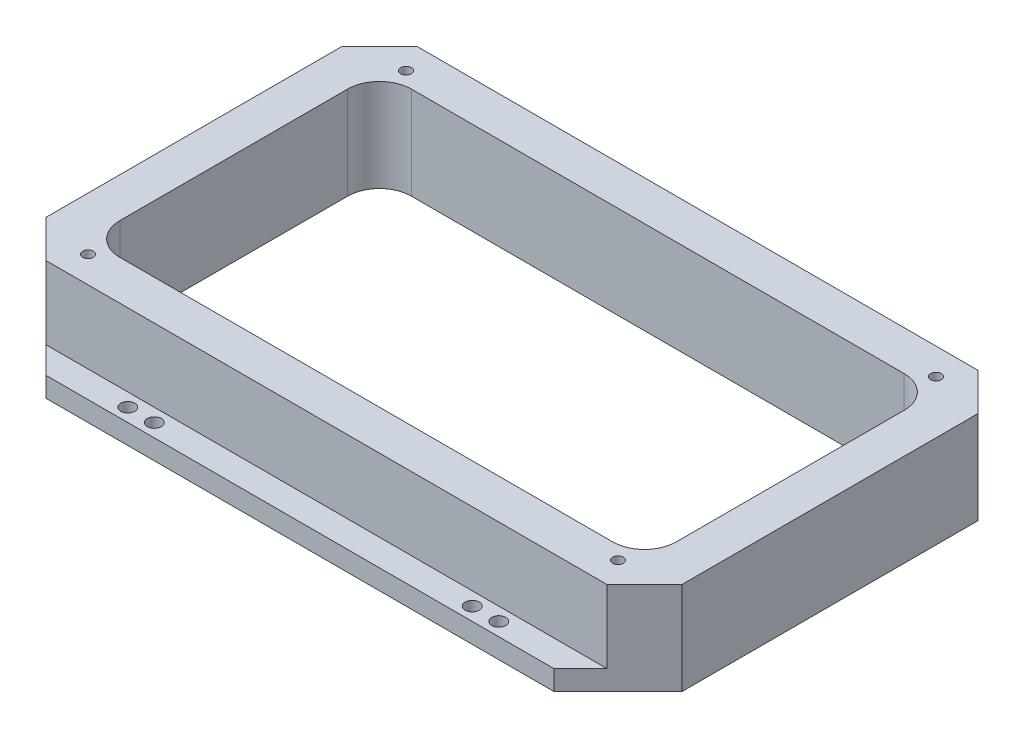
ISO-10303-21;
HEADER;
FILE_DESCRIPTION(('STEP AP214'),'2;1');
FILE_NAME('part.step','',(''),(''),'','','');
FILE_SCHEMA(('AUTOMOTIVE_DESIGN { 1 0 10303 214 1 1 1 1 }'));
ENDSEC;
DATA;
#1=APPLICATION_CONTEXT('core data for automotive mechanical design processes');
#2=APPLICATION_PROTOCOL_DEFINITION('international standard','automotive_design',2000,#1);
#3=PRODUCT_CONTEXT('',#1,'mechanical');
#4=PRODUCT('Part','Part','',(#3));
#5=PRODUCT_RELATED_PRODUCT_CATEGORY('part','',(#4));
#6=PRODUCT_DEFINITION_FORMATION('','',#4);
#7=PRODUCT_DEFINITION_CONTEXT('part definition',#1,'design');
#8=PRODUCT_DEFINITION('design','',#6,#7);
#9=PRODUCT_DEFINITION_SHAPE('','',#8);
#10=(LENGTH_UNIT() NAMED_UNIT(*) SI_UNIT(.MILLI.,.METRE.));
#11=(NAMED_UNIT(*) PLANE_ANGLE_UNIT() SI_UNIT($,.RADIAN.));
#12=(NAMED_UNIT(*) SI_UNIT($,.STERADIAN.) SOLID_ANGLE_UNIT());
#13=UNCERTAINTY_MEASURE_WITH_UNIT(LENGTH_MEASURE(1.E-05),#10,'distance_accuracy_value','');
#14=(GEOMETRIC_REPRESENTATION_CONTEXT(3) GLOBAL_UNCERTAINTY_ASSIGNED_CONTEXT((#13)) GLOBAL_UNIT_ASSIGNED_CONTEXT((#10,
#11,#12)) REPRESENTATION_CONTEXT('',''));
#15=CARTESIAN_POINT('',(0.,0.,0.));
#16=DIRECTION('',(0.,0.,1.));
#17=DIRECTION('',(1.,0.,0.));
#18=AXIS2_PLACEMENT_3D('',#15,#16,#17);
#19=CARTESIAN_POINT('',(0.,9.525,0.));
#20=DIRECTION('',(0.,-1.,0.));
#21=DIRECTION('',(0.,0.,1.));
#22=AXIS2_PLACEMENT_3D('',#19,#20,#21);
#23=PLANE('',#22);
#24=CARTESIAN_POINT('',(-88.9,9.525,-95.25));
#25=DIRECTION('',(0.,1.,0.));
#26=DIRECTION('',(0.,0.,1.));
#27=AXIS2_PLACEMENT_3D('',#24,#25,#26);
#28=CIRCLE('',#27,3.37819999999998);
#29=CARTESIAN_POINT('',(-88.9,9.525,-91.8718));
#30=VERTEX_POINT('',#29);
#31=EDGE_CURVE('E854',#30,#30,#28,.T.);
#32=ORIENTED_EDGE('',*,*,#31,.F.);
#33=EDGE_LOOP('',(#32));
#34=FACE_BOUND('',#33,.T.);
#35=CARTESIAN_POINT('',(-76.2,9.525,-95.25));
#36=DIRECTION('',(0.,1.,0.));
#37=DIRECTION('',(0.,0.,1.));
#38=AXIS2_PLACEMENT_3D('',#35,#36,#37);
#39=CIRCLE('',#38,3.37819999999998);
#40=CARTESIAN_POINT('',(-76.2,9.525,-91.8718));
#41=VERTEX_POINT('',#40);
#42=EDGE_CURVE('E842',#41,#41,#39,.T.);
#43=ORIENTED_EDGE('',*,*,#42,.F.);
#44=EDGE_LOOP('',(#43));
#45=FACE_BOUND('',#44,.T.);
#46=CARTESIAN_POINT('',(76.2,9.525,-95.25));
#47=DIRECTION('',(0.,1.,0.));
#48=DIRECTION('',(0.,0.,1.));
#49=AXIS2_PLACEMENT_3D('',#46,#47,#48);
#50=CIRCLE('',#49,3.37819999999998);
#51=CARTESIAN_POINT('',(76.2,9.525,-91.8718));
#52=VERTEX_POINT('',#51);
#53=EDGE_CURVE('E836',#52,#52,#50,.T.);
#54=ORIENTED_EDGE('',*,*,#53,.F.);
#55=EDGE_LOOP('',(#54));
#56=FACE_BOUND('',#55,.T.);
#57=DIRECTION('',(0.707106781186547,0.,0.707106781186548));
#58=VECTOR('',#57,1.);
#59=CARTESIAN_POINT('',(111.6711,9.525,-111.6711));
#60=LINE('',#59,#58);
#61=CARTESIAN_POINT('',(121.7422,9.525,-101.6));
#62=VERTEX_POINT('',#61);
#63=CARTESIAN_POINT('',(134.4422,9.525,-88.9));
#64=VERTEX_POINT('',#63);
#65=EDGE_CURVE('E194',#62,#64,#60,.T.);
#66=ORIENTED_EDGE('',*,*,#65,.F.);
#67=DIRECTION('',(1.,0.,0.));
#68=VECTOR('',#67,1.);
#69=CARTESIAN_POINT('',(0.,9.525,-101.6));
#70=LINE('',#69,#68);
#71=CARTESIAN_POINT('',(-121.7422,9.525,-101.6));
#72=VERTEX_POINT('',#71);
#73=EDGE_CURVE('E828',#72,#62,#70,.T.);
#74=ORIENTED_EDGE('',*,*,#73,.F.);
#75=DIRECTION('',(0.707106781186546,0.,-0.707106781186549));
#76=VECTOR('',#75,1.);
#77=CARTESIAN_POINT('',(-111.6711,9.525,-111.6711));
#78=LINE('',#77,#76);
#79=CARTESIAN_POINT('',(-134.4422,9.525,-88.8999999999999));
#80=VERTEX_POINT('',#79);
#81=EDGE_CURVE('E197',#80,#72,#78,.T.);
#82=ORIENTED_EDGE('',*,*,#81,.F.);
#83=DIRECTION('',(-1.,0.,0.));
#84=VECTOR('',#83,1.);
#85=CARTESIAN_POINT('',(0.,9.525,-88.9));
#86=LINE('',#85,#84);
#87=EDGE_CURVE('E190',#64,#80,#86,.T.);
#88=ORIENTED_EDGE('',*,*,#87,.F.);
#89=EDGE_LOOP('',(#66,#74,#82,#88));
#90=FACE_BOUND('',#89,.T.);
#91=CARTESIAN_POINT('',(88.9,9.525,-95.25));
#92=DIRECTION('',(0.,1.,0.));
#93=DIRECTION('',(0.,0.,1.));
#94=AXIS2_PLACEMENT_3D('',#91,#92,#93);
#95=CIRCLE('',#94,3.37819999999998);
#96=CARTESIAN_POINT('',(88.9,9.525,-91.8718));
#97=VERTEX_POINT('',#96);
#98=EDGE_CURVE('E848',#97,#97,#95,.T.);
#99=ORIENTED_EDGE('',*,*,#98,.F.);
#100=EDGE_LOOP('',(#99));
#101=FACE_BOUND('',#100,.T.);
#102=ADVANCED_FACE('F41',(#34,#45,#56,#90,#101),#23,.F.);
#103=CARTESIAN_POINT('',(152.4,44.45,88.9));
#104=DIRECTION('',(0.,0.,-1.));
#105=DIRECTION('',(-1.,0.,0.));
#106=AXIS2_PLACEMENT_3D('',#103,#104,#105);
#107=PLANE('',#106);
#108=DIRECTION('',(-1.,0.,0.));
#109=VECTOR('',#108,1.);
#110=CARTESIAN_POINT('',(0.,9.525,88.9));
#111=LINE('',#110,#109);
#112=CARTESIAN_POINT('',(134.4422,9.525,88.9));
#113=VERTEX_POINT('',#112);
#114=CARTESIAN_POINT('',(-134.4422,9.525,88.9));
#115=VERTEX_POINT('',#114);
#116=EDGE_CURVE('E372',#113,#115,#111,.T.);
#117=ORIENTED_EDGE('',*,*,#116,.F.);
#118=DIRECTION('',(0.,1.,0.));
#119=VECTOR('',#118,1.);
#120=CARTESIAN_POINT('',(134.4422,44.45,88.9));
#121=LINE('',#120,#119);
#122=CARTESIAN_POINT('',(134.4422,44.45,88.9));
#123=VERTEX_POINT('',#122);
#124=EDGE_CURVE('E238',#113,#123,#121,.T.);
#125=ORIENTED_EDGE('',*,*,#124,.T.);
#126=DIRECTION('',(1.,0.,0.));
#127=VECTOR('',#126,1.);
#128=CARTESIAN_POINT('',(152.4,44.45,88.9));
#129=LINE('',#128,#127);
#130=CARTESIAN_POINT('',(-134.4422,44.45,88.9));
#131=VERTEX_POINT('',#130);
#132=EDGE_CURVE('E312',#131,#123,#129,.T.);
#133=ORIENTED_EDGE('',*,*,#132,.F.);
#134=DIRECTION('',(0.,-1.,0.));
#135=VECTOR('',#134,1.);
#136=CARTESIAN_POINT('',(-134.4422,44.45,88.9));
#137=LINE('',#136,#135);
#138=EDGE_CURVE('E236',#131,#115,#137,.T.);
#139=ORIENTED_EDGE('',*,*,#138,.T.);
#140=EDGE_LOOP('',(#117,#125,#133,#139));
#141=FACE_BOUND('',#140,.T.);
#142=ADVANCED_FACE('F423',(#141),#107,.F.);
#143=CARTESIAN_POINT('',(-152.4,44.45,88.9));
#144=DIRECTION('',(1.,0.,0.));
#145=DIRECTION('',(0.,0.,-1.));
#146=AXIS2_PLACEMENT_3D('',#143,#144,#145);
#147=PLANE('',#146);
#148=DIRECTION('',(0.,0.,1.));
#149=VECTOR('',#148,1.);
#150=CARTESIAN_POINT('',(-152.4,44.45,88.9));
#151=LINE('',#150,#149);
#152=CARTESIAN_POINT('',(-152.4,44.45,-70.9422));
#153=VERTEX_POINT('',#152);
#154=CARTESIAN_POINT('',(-152.4,44.45,70.9421999999999));
#155=VERTEX_POINT('',#154);
#156=EDGE_CURVE('E309',#153,#155,#151,.T.);
#157=ORIENTED_EDGE('',*,*,#156,.F.);
#158=DIRECTION('',(0.,-1.,0.));
#159=VECTOR('',#158,1.);
#160=CARTESIAN_POINT('',(-152.4,44.45,-70.9422));
#161=LINE('',#160,#159);
#162=CARTESIAN_POINT('',(-152.4,0.,-70.9422));
#163=VERTEX_POINT('',#162);
#164=EDGE_CURVE('E326',#153,#163,#161,.T.);
#165=ORIENTED_EDGE('',*,*,#164,.T.);
#166=DIRECTION('',(0.,0.,1.));
#167=VECTOR('',#166,1.);
#168=CARTESIAN_POINT('',(-152.4,0.,88.9));
#169=LINE('',#168,#167);
#170=CARTESIAN_POINT('',(-152.4,0.,70.9421999999999));
#171=VERTEX_POINT('',#170);
#172=EDGE_CURVE('E301',#163,#171,#169,.T.);
#173=ORIENTED_EDGE('',*,*,#172,.T.);
#174=DIRECTION('',(0.,1.,0.));
#175=VECTOR('',#174,1.);
#176=CARTESIAN_POINT('',(-152.4,44.45,70.9421999999999));
#177=LINE('',#176,#175);
#178=EDGE_CURVE('E320',#171,#155,#177,.T.);
#179=ORIENTED_EDGE('',*,*,#178,.T.);
#180=EDGE_LOOP('',(#157,#165,#173,#179));
#181=FACE_BOUND('',#180,.T.);
#182=ADVANCED_FACE('F429',(#181),#147,.F.);
#183=CARTESIAN_POINT('',(152.4,44.45,88.9));
#184=DIRECTION('',(-1.,0.,0.));
#185=DIRECTION('',(0.,0.,1.));
#186=AXIS2_PLACEMENT_3D('',#183,#184,#185);
#187=PLANE('',#186);
#188=DIRECTION('',(0.,0.,-1.));
#189=VECTOR('',#188,1.);
#190=CARTESIAN_POINT('',(152.4,0.,88.9));
#191=LINE('',#190,#189);
#192=CARTESIAN_POINT('',(152.4,0.,70.9422));
#193=VERTEX_POINT('',#192);
#194=CARTESIAN_POINT('',(152.4,0.,-70.9422));
#195=VERTEX_POINT('',#194);
#196=EDGE_CURVE('E313',#193,#195,#191,.T.);
#197=ORIENTED_EDGE('',*,*,#196,.T.);
#198=DIRECTION('',(0.,1.,0.));
#199=VECTOR('',#198,1.);
#200=CARTESIAN_POINT('',(152.4,44.45,-70.9422));
#201=LINE('',#200,#199);
#202=CARTESIAN_POINT('',(152.4,44.45,-70.9422));
#203=VERTEX_POINT('',#202);
#204=EDGE_CURVE('E234',#195,#203,#201,.T.);
#205=ORIENTED_EDGE('',*,*,#204,.T.);
#206=DIRECTION('',(0.,0.,-1.));
#207=VECTOR('',#206,1.);
#208=CARTESIAN_POINT('',(152.4,44.45,88.9));
#209=LINE('',#208,#207);
#210=CARTESIAN_POINT('',(152.4,44.45,70.9422));
#211=VERTEX_POINT('',#210);
#212=EDGE_CURVE('E316',#211,#203,#209,.T.);
#213=ORIENTED_EDGE('',*,*,#212,.F.);
#214=DIRECTION('',(0.,-1.,0.));
#215=VECTOR('',#214,1.);
#216=CARTESIAN_POINT('',(152.4,44.45,70.9422));
#217=LINE('',#216,#215);
#218=EDGE_CURVE('E231',#211,#193,#217,.T.);
#219=ORIENTED_EDGE('',*,*,#218,.T.);
#220=EDGE_LOOP('',(#197,#205,#213,#219));
#221=FACE_BOUND('',#220,.T.);
#222=ADVANCED_FACE('F340',(#221),#187,.F.);
#223=CARTESIAN_POINT('',(152.4,44.45,-88.8999999999999));
#224=DIRECTION('',(0.,0.,1.));
#225=DIRECTION('',(1.,0.,0.));
#226=AXIS2_PLACEMENT_3D('',#223,#224,#225);
#227=PLANE('',#226);
#228=DIRECTION('',(0.,-1.,0.));
#229=VECTOR('',#228,1.);
#230=CARTESIAN_POINT('',(134.4422,44.45,-88.8999999999999));
#231=LINE('',#230,#229);
#232=CARTESIAN_POINT('',(134.4422,44.45,-88.8999999999999));
#233=VERTEX_POINT('',#232);
#234=EDGE_CURVE('E206',#233,#64,#231,.T.);
#235=ORIENTED_EDGE('',*,*,#234,.T.);
#236=ORIENTED_EDGE('',*,*,#87,.T.);
#237=DIRECTION('',(0.,1.,0.));
#238=VECTOR('',#237,1.);
#239=CARTESIAN_POINT('',(-134.4422,44.45,-88.8999999999999));
#240=LINE('',#239,#238);
#241=CARTESIAN_POINT('',(-134.4422,44.45,-88.8999999999999));
#242=VERTEX_POINT('',#241);
#243=EDGE_CURVE('E215',#80,#242,#240,.T.);
#244=ORIENTED_EDGE('',*,*,#243,.T.);
#245=DIRECTION('',(-1.,0.,0.));
#246=VECTOR('',#245,1.);
#247=CARTESIAN_POINT('',(152.4,44.45,-88.8999999999999));
#248=LINE('',#247,#246);
#249=EDGE_CURVE('E214',#233,#242,#248,.T.);
#250=ORIENTED_EDGE('',*,*,#249,.F.);
#251=EDGE_LOOP('',(#235,#236,#244,#250));
#252=FACE_BOUND('',#251,.T.);
#253=ADVANCED_FACE('F212',(#252),#227,.F.);
#254=CARTESIAN_POINT('',(0.,44.45,0.));
#255=DIRECTION('',(0.,1.,0.));
#256=DIRECTION('',(0.,0.,1.));
#257=AXIS2_PLACEMENT_3D('',#254,#255,#256);
#258=PLANE('',#257);
#259=CARTESIAN_POINT('',(-127.,44.45,-76.2));
#260=DIRECTION('',(0.,1.,0.));
#261=DIRECTION('',(0.,0.,1.));
#262=AXIS2_PLACEMENT_3D('',#259,#260,#261);
#263=CIRCLE('',#262,2.55269999999999);
#264=CARTESIAN_POINT('',(-127.,44.45,-73.6473));
#265=VERTEX_POINT('',#264);
#266=EDGE_CURVE('E375',#265,#265,#263,.T.);
#267=ORIENTED_EDGE('',*,*,#266,.F.);
#268=EDGE_LOOP('',(#267));
#269=FACE_BOUND('',#268,.T.);
#270=CARTESIAN_POINT('',(127.,44.45,-76.2));
#271=DIRECTION('',(0.,1.,0.));
#272=DIRECTION('',(0.,0.,1.));
#273=AXIS2_PLACEMENT_3D('',#270,#271,#272);
#274=CIRCLE('',#273,2.55269999999999);
#275=CARTESIAN_POINT('',(127.,44.45,-73.6473));
#276=VERTEX_POINT('',#275);
#277=EDGE_CURVE('E382',#276,#276,#274,.T.);
#278=ORIENTED_EDGE('',*,*,#277,.F.);
#279=EDGE_LOOP('',(#278));
#280=FACE_BOUND('',#279,.T.);
#281=CARTESIAN_POINT('',(127.000000000004,44.45,76.2));
#282=DIRECTION('',(0.,1.,0.));
#283=DIRECTION('',(0.,0.,1.));
#284=AXIS2_PLACEMENT_3D('',#281,#282,#283);
#285=CIRCLE('',#284,2.55269999999999);
#286=CARTESIAN_POINT('',(127.000000000004,44.45,78.7527));
#287=VERTEX_POINT('',#286);
#288=EDGE_CURVE('E388',#287,#287,#285,.T.);
#289=ORIENTED_EDGE('',*,*,#288,.F.);
#290=EDGE_LOOP('',(#289));
#291=FACE_BOUND('',#290,.T.);
#292=CARTESIAN_POINT('',(-126.999999999996,44.45,76.2));
#293=DIRECTION('',(0.,1.,0.));
#294=DIRECTION('',(0.,0.,1.));
#295=AXIS2_PLACEMENT_3D('',#292,#293,#294);
#296=CIRCLE('',#295,2.55269999999999);
#297=CARTESIAN_POINT('',(-126.999999999996,44.45,78.7527));
#298=VERTEX_POINT('',#297);
#299=EDGE_CURVE('E394',#298,#298,#296,.T.);
#300=ORIENTED_EDGE('',*,*,#299,.F.);
#301=EDGE_LOOP('',(#300));
#302=FACE_BOUND('',#301,.T.);
#303=DIRECTION('',(0.,0.,-1.));
#304=VECTOR('',#303,1.);
#305=CARTESIAN_POINT('',(133.35,44.45,0.));
#306=LINE('',#305,#304);
#307=CARTESIAN_POINT('',(133.35,44.45,54.61));
#308=VERTEX_POINT('',#307);
#309=CARTESIAN_POINT('',(133.35,44.45,-54.61));
#310=VERTEX_POINT('',#309);
#311=EDGE_CURVE('E276',#308,#310,#306,.T.);
#312=ORIENTED_EDGE('',*,*,#311,.F.);
#313=CARTESIAN_POINT('',(118.11,44.45,54.61));
#314=DIRECTION('',(0.,1.,0.));
#315=DIRECTION('',(0.,0.,1.));
#316=AXIS2_PLACEMENT_3D('',#313,#314,#315);
#317=CIRCLE('',#316,15.24);
#318=CARTESIAN_POINT('',(118.11,44.45,69.85));
#319=VERTEX_POINT('',#318);
#320=EDGE_CURVE('E259',#308,#319,#317,.F.);
#321=ORIENTED_EDGE('',*,*,#320,.T.);
#322=DIRECTION('',(1.,0.,0.));
#323=VECTOR('',#322,1.);
#324=CARTESIAN_POINT('',(0.,44.45,69.85));
#325=LINE('',#324,#323);
#326=CARTESIAN_POINT('',(-118.11,44.45,69.85));
#327=VERTEX_POINT('',#326);
#328=EDGE_CURVE('E296',#327,#319,#325,.T.);
#329=ORIENTED_EDGE('',*,*,#328,.F.);
#330=CARTESIAN_POINT('',(-118.11,44.45,54.61));
#331=DIRECTION('',(0.,1.,0.));
#332=DIRECTION('',(0.,0.,1.));
#333=AXIS2_PLACEMENT_3D('',#330,#331,#332);
#334=CIRCLE('',#333,15.24);
#335=CARTESIAN_POINT('',(-133.35,44.45,54.61));
#336=VERTEX_POINT('',#335);
#337=EDGE_CURVE('E263',#327,#336,#334,.F.);
#338=ORIENTED_EDGE('',*,*,#337,.T.);
#339=DIRECTION('',(0.,0.,1.));
#340=VECTOR('',#339,1.);
#341=CARTESIAN_POINT('',(-133.35,44.45,0.));
#342=LINE('',#341,#340);
#343=CARTESIAN_POINT('',(-133.35,44.45,-54.6099999999999));
#344=VERTEX_POINT('',#343);
#345=EDGE_CURVE('E304',#344,#336,#342,.T.);
#346=ORIENTED_EDGE('',*,*,#345,.F.);
#347=CARTESIAN_POINT('',(-118.11,44.45,-54.6099999999999));
#348=DIRECTION('',(0.,1.,0.));
#349=DIRECTION('',(0.,0.,1.));
#350=AXIS2_PLACEMENT_3D('',#347,#348,#349);
#351=CIRCLE('',#350,15.24);
#352=CARTESIAN_POINT('',(-118.11,44.45,-69.8499999999999));
#353=VERTEX_POINT('',#352);
#354=EDGE_CURVE('E267',#344,#353,#351,.F.);
#355=ORIENTED_EDGE('',*,*,#354,.T.);
#356=DIRECTION('',(-1.,0.,0.));
#357=VECTOR('',#356,1.);
#358=CARTESIAN_POINT('',(0.,44.45,-69.8499999999999));
#359=LINE('',#358,#357);
#360=CARTESIAN_POINT('',(118.11,44.45,-69.85));
#361=VERTEX_POINT('',#360);
#362=EDGE_CURVE('E277',#361,#353,#359,.T.);
#363=ORIENTED_EDGE('',*,*,#362,.F.);
#364=CARTESIAN_POINT('',(118.11,44.45,-54.61));
#365=DIRECTION('',(0.,1.,0.));
#366=DIRECTION('',(0.,0.,1.));
#367=AXIS2_PLACEMENT_3D('',#364,#365,#366);
#368=CIRCLE('',#367,15.24);
#369=EDGE_CURVE('E49',#361,#310,#368,.F.);
#370=ORIENTED_EDGE('',*,*,#369,.T.);
#371=EDGE_LOOP('',(#312,#321,#329,#338,#346,#355,#363,#370));
#372=FACE_BOUND('',#371,.T.);
#373=ORIENTED_EDGE('',*,*,#249,.T.);
#374=DIRECTION('',(0.70710678118655,0.,-0.707106781186545));
#375=VECTOR('',#374,1.);
#376=CARTESIAN_POINT('',(-111.6711,44.45,-111.6711));
#377=LINE('',#376,#375);
#378=EDGE_CURVE('E229',#242,#153,#377,.F.);
#379=ORIENTED_EDGE('',*,*,#378,.T.);
#380=ORIENTED_EDGE('',*,*,#156,.T.);
#381=DIRECTION('',(-0.707106781186547,0.,-0.707106781186548));
#382=VECTOR('',#381,1.);
#383=CARTESIAN_POINT('',(-111.6711,44.45,111.6711));
#384=LINE('',#383,#382);
#385=EDGE_CURVE('E218',#155,#131,#384,.F.);
#386=ORIENTED_EDGE('',*,*,#385,.T.);
#387=ORIENTED_EDGE('',*,*,#132,.T.);
#388=DIRECTION('',(-0.707106781186548,0.,0.707106781186548));
#389=VECTOR('',#388,1.);
#390=CARTESIAN_POINT('',(111.6711,44.45,111.6711));
#391=LINE('',#390,#389);
#392=EDGE_CURVE('E225',#123,#211,#391,.F.);
#393=ORIENTED_EDGE('',*,*,#392,.T.);
#394=ORIENTED_EDGE('',*,*,#212,.T.);
#395=DIRECTION('',(0.707106781186548,0.,0.707106781186548));
#396=VECTOR('',#395,1.);
#397=CARTESIAN_POINT('',(111.6711,44.45,-111.6711));
#398=LINE('',#397,#396);
#399=EDGE_CURVE('E227',#203,#233,#398,.F.);
#400=ORIENTED_EDGE('',*,*,#399,.T.);
#401=EDGE_LOOP('',(#373,#379,#380,#386,#387,#393,#394,#400));
#402=FACE_BOUND('',#401,.T.);
#403=ADVANCED_FACE('F274',(#269,#280,#291,#302,#372,#402),#258,.T.);
#404=CARTESIAN_POINT('',(0.,0.,0.));
#405=DIRECTION('',(0.,1.,0.));
#406=DIRECTION('',(0.,0.,1.));
#407=AXIS2_PLACEMENT_3D('',#404,#405,#406);
#408=PLANE('',#407);
#409=CARTESIAN_POINT('',(-88.9,0.,-95.25));
#410=DIRECTION('',(0.,1.,0.));
#411=DIRECTION('',(0.,0.,1.));
#412=AXIS2_PLACEMENT_3D('',#409,#410,#411);
#413=CIRCLE('',#412,3.3782);
#414=CARTESIAN_POINT('',(-88.9,0.,-91.8718));
#415=VERTEX_POINT('',#414);
#416=EDGE_CURVE('E851',#415,#415,#413,.T.);
#417=ORIENTED_EDGE('',*,*,#416,.T.);
#418=EDGE_LOOP('',(#417));
#419=FACE_BOUND('',#418,.T.);
#420=CARTESIAN_POINT('',(88.9,0.,-95.25));
#421=DIRECTION('',(0.,1.,0.));
#422=DIRECTION('',(0.,0.,1.));
#423=AXIS2_PLACEMENT_3D('',#420,#421,#422);
#424=CIRCLE('',#423,3.3782);
#425=CARTESIAN_POINT('',(88.9,0.,-91.8718));
#426=VERTEX_POINT('',#425);
#427=EDGE_CURVE('E845',#426,#426,#424,.T.);
#428=ORIENTED_EDGE('',*,*,#427,.T.);
#429=EDGE_LOOP('',(#428));
#430=FACE_BOUND('',#429,.T.);
#431=CARTESIAN_POINT('',(-76.2,0.,-95.25));
#432=DIRECTION('',(0.,1.,0.));
#433=DIRECTION('',(0.,0.,1.));
#434=AXIS2_PLACEMENT_3D('',#431,#432,#433);
#435=CIRCLE('',#434,3.3782);
#436=CARTESIAN_POINT('',(-76.2,0.,-91.8718));
#437=VERTEX_POINT('',#436);
#438=EDGE_CURVE('E839',#437,#437,#435,.T.);
#439=ORIENTED_EDGE('',*,*,#438,.T.);
#440=EDGE_LOOP('',(#439));
#441=FACE_BOUND('',#440,.T.);
#442=CARTESIAN_POINT('',(76.2,0.,-95.25));
#443=DIRECTION('',(0.,1.,0.));
#444=DIRECTION('',(0.,0.,1.));
#445=AXIS2_PLACEMENT_3D('',#442,#443,#444);
#446=CIRCLE('',#445,3.3782);
#447=CARTESIAN_POINT('',(76.2,0.,-91.8718));
#448=VERTEX_POINT('',#447);
#449=EDGE_CURVE('E831',#448,#448,#446,.T.);
#450=ORIENTED_EDGE('',*,*,#449,.T.);
#451=EDGE_LOOP('',(#450));
#452=FACE_BOUND('',#451,.T.);
#453=CARTESIAN_POINT('',(-88.9,0.,95.25));
#454=DIRECTION('',(0.,1.,0.));
#455=DIRECTION('',(0.,0.,1.));
#456=AXIS2_PLACEMENT_3D('',#453,#454,#455);
#457=CIRCLE('',#456,3.3782);
#458=CARTESIAN_POINT('',(-88.9,0.,98.6282));
#459=VERTEX_POINT('',#458);
#460=EDGE_CURVE('E821',#459,#459,#457,.T.);
#461=ORIENTED_EDGE('',*,*,#460,.T.);
#462=EDGE_LOOP('',(#461));
#463=FACE_BOUND('',#462,.T.);
#464=CARTESIAN_POINT('',(88.9,0.,95.25));
#465=DIRECTION('',(0.,1.,0.));
#466=DIRECTION('',(0.,0.,1.));
#467=AXIS2_PLACEMENT_3D('',#464,#465,#466);
#468=CIRCLE('',#467,3.3782);
#469=CARTESIAN_POINT('',(88.9,0.,98.6282));
#470=VERTEX_POINT('',#469);
#471=EDGE_CURVE('E815',#470,#470,#468,.T.);
#472=ORIENTED_EDGE('',*,*,#471,.T.);
#473=EDGE_LOOP('',(#472));
#474=FACE_BOUND('',#473,.T.);
#475=CARTESIAN_POINT('',(-76.2,0.,95.25));
#476=DIRECTION('',(0.,1.,0.));
#477=DIRECTION('',(0.,0.,1.));
#478=AXIS2_PLACEMENT_3D('',#475,#476,#477);
#479=CIRCLE('',#478,3.3782);
#480=CARTESIAN_POINT('',(-76.2,0.,98.6282));
#481=VERTEX_POINT('',#480);
#482=EDGE_CURVE('E809',#481,#481,#479,.T.);
#483=ORIENTED_EDGE('',*,*,#482,.T.);
#484=EDGE_LOOP('',(#483));
#485=FACE_BOUND('',#484,.T.);
#486=CARTESIAN_POINT('',(76.2,0.,95.25));
#487=DIRECTION('',(0.,1.,0.));
#488=DIRECTION('',(0.,0.,1.));
#489=AXIS2_PLACEMENT_3D('',#486,#487,#488);
#490=CIRCLE('',#489,3.3782);
#491=CARTESIAN_POINT('',(76.2,0.,98.6282));
#492=VERTEX_POINT('',#491);
#493=EDGE_CURVE('E362',#492,#492,#490,.T.);
#494=ORIENTED_EDGE('',*,*,#493,.T.);
#495=EDGE_LOOP('',(#494));
#496=FACE_BOUND('',#495,.T.);
#497=DIRECTION('',(0.,0.,1.));
#498=VECTOR('',#497,1.);
#499=CARTESIAN_POINT('',(-133.35,0.,0.));
#500=LINE('',#499,#498);
#501=CARTESIAN_POINT('',(-133.35,0.,-54.6099999999999));
#502=VERTEX_POINT('',#501);
#503=CARTESIAN_POINT('',(-133.35,0.,54.61));
#504=VERTEX_POINT('',#503);
#505=EDGE_CURVE('E290',#502,#504,#500,.T.);
#506=ORIENTED_EDGE('',*,*,#505,.T.);
#507=CARTESIAN_POINT('',(-118.11,0.,54.61));
#508=DIRECTION('',(0.,1.,0.));
#509=DIRECTION('',(0.,0.,1.));
#510=AXIS2_PLACEMENT_3D('',#507,#508,#509);
#511=CIRCLE('',#510,15.24);
#512=CARTESIAN_POINT('',(-118.11,0.,69.85));
#513=VERTEX_POINT('',#512);
#514=EDGE_CURVE('E265',#504,#513,#511,.T.);
#515=ORIENTED_EDGE('',*,*,#514,.T.);
#516=DIRECTION('',(1.,0.,0.));
#517=VECTOR('',#516,1.);
#518=CARTESIAN_POINT('',(0.,0.,69.85));
#519=LINE('',#518,#517);
#520=CARTESIAN_POINT('',(118.11,0.,69.85));
#521=VERTEX_POINT('',#520);
#522=EDGE_CURVE('E294',#513,#521,#519,.T.);
#523=ORIENTED_EDGE('',*,*,#522,.T.);
#524=CARTESIAN_POINT('',(118.11,0.,54.61));
#525=DIRECTION('',(0.,1.,0.));
#526=DIRECTION('',(0.,0.,1.));
#527=AXIS2_PLACEMENT_3D('',#524,#525,#526);
#528=CIRCLE('',#527,15.24);
#529=CARTESIAN_POINT('',(133.35,0.,54.61));
#530=VERTEX_POINT('',#529);
#531=EDGE_CURVE('E261',#521,#530,#528,.T.);
#532=ORIENTED_EDGE('',*,*,#531,.T.);
#533=DIRECTION('',(0.,0.,-1.));
#534=VECTOR('',#533,1.);
#535=CARTESIAN_POINT('',(133.35,0.,0.));
#536=LINE('',#535,#534);
#537=CARTESIAN_POINT('',(133.35,0.,-54.61));
#538=VERTEX_POINT('',#537);
#539=EDGE_CURVE('E291',#530,#538,#536,.T.);
#540=ORIENTED_EDGE('',*,*,#539,.T.);
#541=CARTESIAN_POINT('',(118.11,0.,-54.61));
#542=DIRECTION('',(0.,1.,0.));
#543=DIRECTION('',(0.,0.,1.));
#544=AXIS2_PLACEMENT_3D('',#541,#542,#543);
#545=CIRCLE('',#544,15.24);
#546=CARTESIAN_POINT('',(118.11,0.,-69.85));
#547=VERTEX_POINT('',#546);
#548=EDGE_CURVE('E11',#538,#547,#545,.T.);
#549=ORIENTED_EDGE('',*,*,#548,.T.);
#550=DIRECTION('',(-1.,0.,0.));
#551=VECTOR('',#550,1.);
#552=CARTESIAN_POINT('',(0.,0.,-69.8499999999999));
#553=LINE('',#552,#551);
#554=CARTESIAN_POINT('',(-118.11,0.,-69.8499999999999));
#555=VERTEX_POINT('',#554);
#556=EDGE_CURVE('E288',#547,#555,#553,.T.);
#557=ORIENTED_EDGE('',*,*,#556,.T.);
#558=CARTESIAN_POINT('',(-118.11,0.,-54.6099999999999));
#559=DIRECTION('',(0.,1.,0.));
#560=DIRECTION('',(0.,0.,1.));
#561=AXIS2_PLACEMENT_3D('',#558,#559,#560);
#562=CIRCLE('',#561,15.24);
#563=EDGE_CURVE('E269',#555,#502,#562,.T.);
#564=ORIENTED_EDGE('',*,*,#563,.T.);
#565=EDGE_LOOP('',(#506,#515,#523,#532,#540,#549,#557,#564));
#566=FACE_BOUND('',#565,.T.);
#567=ORIENTED_EDGE('',*,*,#172,.F.);
#568=DIRECTION('',(-0.70710678118655,0.,0.707106781186545));
#569=VECTOR('',#568,1.);
#570=CARTESIAN_POINT('',(-152.4,0.,-70.9422));
#571=LINE('',#570,#569);
#572=CARTESIAN_POINT('',(-121.7422,0.,-101.6));
#573=VERTEX_POINT('',#572);
#574=EDGE_CURVE('E216',#163,#573,#571,.F.);
#575=ORIENTED_EDGE('',*,*,#574,.T.);
#576=DIRECTION('',(1.,0.,0.));
#577=VECTOR('',#576,1.);
#578=CARTESIAN_POINT('',(0.,0.,-101.6));
#579=LINE('',#578,#577);
#580=CARTESIAN_POINT('',(121.7422,0.,-101.6));
#581=VERTEX_POINT('',#580);
#582=EDGE_CURVE('E209',#573,#581,#579,.T.);
#583=ORIENTED_EDGE('',*,*,#582,.T.);
#584=DIRECTION('',(-0.707106781186548,0.,-0.707106781186548));
#585=VECTOR('',#584,1.);
#586=CARTESIAN_POINT('',(134.4422,0.,-88.8999999999999));
#587=LINE('',#586,#585);
#588=EDGE_CURVE('E220',#581,#195,#587,.F.);
#589=ORIENTED_EDGE('',*,*,#588,.T.);
#590=ORIENTED_EDGE('',*,*,#196,.F.);
#591=DIRECTION('',(0.707106781186548,0.,-0.707106781186548));
#592=VECTOR('',#591,1.);
#593=CARTESIAN_POINT('',(152.4,0.,70.9422));
#594=LINE('',#593,#592);
#595=CARTESIAN_POINT('',(121.7422,0.,101.6));
#596=VERTEX_POINT('',#595);
#597=EDGE_CURVE('E331',#193,#596,#594,.F.);
#598=ORIENTED_EDGE('',*,*,#597,.T.);
#599=DIRECTION('',(1.,0.,0.));
#600=VECTOR('',#599,1.);
#601=CARTESIAN_POINT('',(0.,0.,101.6));
#602=LINE('',#601,#600);
#603=CARTESIAN_POINT('',(-121.7422,0.,101.6));
#604=VERTEX_POINT('',#603);
#605=EDGE_CURVE('E354',#604,#596,#602,.T.);
#606=ORIENTED_EDGE('',*,*,#605,.F.);
#607=DIRECTION('',(0.707106781186547,0.,0.707106781186548));
#608=VECTOR('',#607,1.);
#609=CARTESIAN_POINT('',(-134.4422,0.,88.9));
#610=LINE('',#609,#608);
#611=EDGE_CURVE('E329',#604,#171,#610,.F.);
#612=ORIENTED_EDGE('',*,*,#611,.T.);
#613=EDGE_LOOP('',(#567,#575,#583,#589,#590,#598,#606,#612));
#614=FACE_BOUND('',#613,.T.);
#615=ADVANCED_FACE('F336',(#419,#430,#441,#452,#463,#474,#485,#496,#566,#614),#408,.F.);
#616=CARTESIAN_POINT('',(-152.4,44.45,-70.9422));
#617=DIRECTION('',(0.707106781186545,0.,0.70710678118655));
#618=DIRECTION('',(0.,-1.,0.));
#619=AXIS2_PLACEMENT_3D('',#616,#617,#618);
#620=PLANE('',#619);
#621=ORIENTED_EDGE('',*,*,#378,.F.);
#622=ORIENTED_EDGE('',*,*,#243,.F.);
#623=ORIENTED_EDGE('',*,*,#81,.T.);
#624=DIRECTION('',(0.,-1.,0.));
#625=VECTOR('',#624,1.);
#626=CARTESIAN_POINT('',(-121.7422,9.525,-101.6));
#627=LINE('',#626,#625);
#628=EDGE_CURVE('E798',#72,#573,#627,.T.);
#629=ORIENTED_EDGE('',*,*,#628,.T.);
#630=ORIENTED_EDGE('',*,*,#574,.F.);
#631=ORIENTED_EDGE('',*,*,#164,.F.);
#632=EDGE_LOOP('',(#621,#622,#623,#629,#630,#631));
#633=FACE_BOUND('',#632,.T.);
#634=ADVANCED_FACE('F415',(#633),#620,.F.);
#635=CARTESIAN_POINT('',(134.4422,44.45,-88.8999999999999));
#636=DIRECTION('',(-0.707106781186548,0.,0.707106781186548));
#637=DIRECTION('',(0.,-1.,0.));
#638=AXIS2_PLACEMENT_3D('',#635,#636,#637);
#639=PLANE('',#638);
#640=ORIENTED_EDGE('',*,*,#399,.F.);
#641=ORIENTED_EDGE('',*,*,#204,.F.);
#642=ORIENTED_EDGE('',*,*,#588,.F.);
#643=DIRECTION('',(0.,-1.,0.));
#644=VECTOR('',#643,1.);
#645=CARTESIAN_POINT('',(121.7422,9.525,-101.6));
#646=LINE('',#645,#644);
#647=EDGE_CURVE('E208',#62,#581,#646,.T.);
#648=ORIENTED_EDGE('',*,*,#647,.F.);
#649=ORIENTED_EDGE('',*,*,#65,.T.);
#650=ORIENTED_EDGE('',*,*,#234,.F.);
#651=EDGE_LOOP('',(#640,#641,#642,#648,#649,#650));
#652=FACE_BOUND('',#651,.T.);
#653=ADVANCED_FACE('F205',(#652),#639,.F.);
#654=CARTESIAN_POINT('',(152.4,44.45,70.9422));
#655=DIRECTION('',(-0.707106781186548,0.,-0.707106781186548));
#656=DIRECTION('',(0.,-1.,0.));
#657=AXIS2_PLACEMENT_3D('',#654,#655,#656);
#658=PLANE('',#657);
#659=ORIENTED_EDGE('',*,*,#392,.F.);
#660=ORIENTED_EDGE('',*,*,#124,.F.);
#661=DIRECTION('',(0.707106781186547,0.,-0.707106781186548));
#662=VECTOR('',#661,1.);
#663=CARTESIAN_POINT('',(111.6711,9.525,111.6711));
#664=LINE('',#663,#662);
#665=CARTESIAN_POINT('',(121.7422,9.525,101.6));
#666=VERTEX_POINT('',#665);
#667=EDGE_CURVE('E361',#666,#113,#664,.T.);
#668=ORIENTED_EDGE('',*,*,#667,.F.);
#669=DIRECTION('',(0.,-1.,0.));
#670=VECTOR('',#669,1.);
#671=CARTESIAN_POINT('',(121.7422,9.525,101.6));
#672=LINE('',#671,#670);
#673=EDGE_CURVE('E351',#666,#596,#672,.T.);
#674=ORIENTED_EDGE('',*,*,#673,.T.);
#675=ORIENTED_EDGE('',*,*,#597,.F.);
#676=ORIENTED_EDGE('',*,*,#218,.F.);
#677=EDGE_LOOP('',(#659,#660,#668,#674,#675,#676));
#678=FACE_BOUND('',#677,.T.);
#679=ADVANCED_FACE('F346',(#678),#658,.F.);
#680=CARTESIAN_POINT('',(-134.4422,44.45,88.9));
#681=DIRECTION('',(0.707106781186548,0.,-0.707106781186547));
#682=DIRECTION('',(0.,-1.,0.));
#683=AXIS2_PLACEMENT_3D('',#680,#681,#682);
#684=PLANE('',#683);
#685=ORIENTED_EDGE('',*,*,#385,.F.);
#686=ORIENTED_EDGE('',*,*,#178,.F.);
#687=ORIENTED_EDGE('',*,*,#611,.F.);
#688=DIRECTION('',(0.,-1.,0.));
#689=VECTOR('',#688,1.);
#690=CARTESIAN_POINT('',(-121.7422,9.525,101.6));
#691=LINE('',#690,#689);
#692=CARTESIAN_POINT('',(-121.7422,9.525,101.6));
#693=VERTEX_POINT('',#692);
#694=EDGE_CURVE('E360',#693,#604,#691,.T.);
#695=ORIENTED_EDGE('',*,*,#694,.F.);
#696=DIRECTION('',(0.707106781186546,0.,0.707106781186549));
#697=VECTOR('',#696,1.);
#698=CARTESIAN_POINT('',(-111.6711,9.525,111.6711));
#699=LINE('',#698,#697);
#700=EDGE_CURVE('E804',#115,#693,#699,.T.);
#701=ORIENTED_EDGE('',*,*,#700,.F.);
#702=ORIENTED_EDGE('',*,*,#138,.F.);
#703=EDGE_LOOP('',(#685,#686,#687,#695,#701,#702));
#704=FACE_BOUND('',#703,.T.);
#705=ADVANCED_FACE('F500',(#704),#684,.F.);
#706=CARTESIAN_POINT('',(133.35,0.,0.));
#707=DIRECTION('',(1.,0.,0.));
#708=DIRECTION('',(0.,0.,-1.));
#709=AXIS2_PLACEMENT_3D('',#706,#707,#708);
#710=PLANE('',#709);
#711=ORIENTED_EDGE('',*,*,#539,.F.);
#712=DIRECTION('',(0.,1.,0.));
#713=VECTOR('',#712,1.);
#714=CARTESIAN_POINT('',(133.35,44.45,54.61));
#715=LINE('',#714,#713);
#716=EDGE_CURVE('E242',#530,#308,#715,.T.);
#717=ORIENTED_EDGE('',*,*,#716,.T.);
#718=ORIENTED_EDGE('',*,*,#311,.T.);
#719=DIRECTION('',(0.,1.,0.));
#720=VECTOR('',#719,1.);
#721=CARTESIAN_POINT('',(133.35,0.,-54.61));
#722=LINE('',#721,#720);
#723=EDGE_CURVE('E240',#310,#538,#722,.F.);
#724=ORIENTED_EDGE('',*,*,#723,.T.);
#725=EDGE_LOOP('',(#711,#717,#718,#724));
#726=FACE_BOUND('',#725,.T.);
#727=ADVANCED_FACE('F283',(#726),#710,.F.);
#728=CARTESIAN_POINT('',(0.,0.,69.85));
#729=DIRECTION('',(0.,0.,1.));
#730=DIRECTION('',(1.,0.,0.));
#731=AXIS2_PLACEMENT_3D('',#728,#729,#730);
#732=PLANE('',#731);
#733=ORIENTED_EDGE('',*,*,#328,.T.);
#734=DIRECTION('',(0.,1.,0.));
#735=VECTOR('',#734,1.);
#736=CARTESIAN_POINT('',(118.11,0.,69.85));
#737=LINE('',#736,#735);
#738=EDGE_CURVE('E248',#319,#521,#737,.F.);
#739=ORIENTED_EDGE('',*,*,#738,.T.);
#740=ORIENTED_EDGE('',*,*,#522,.F.);
#741=DIRECTION('',(0.,1.,0.));
#742=VECTOR('',#741,1.);
#743=CARTESIAN_POINT('',(-118.11,44.45,69.85));
#744=LINE('',#743,#742);
#745=EDGE_CURVE('E245',#513,#327,#744,.T.);
#746=ORIENTED_EDGE('',*,*,#745,.T.);
#747=EDGE_LOOP('',(#733,#739,#740,#746));
#748=FACE_BOUND('',#747,.T.);
#749=ADVANCED_FACE('F490',(#748),#732,.F.);
#750=CARTESIAN_POINT('',(-133.35,0.,0.));
#751=DIRECTION('',(-1.,0.,0.));
#752=DIRECTION('',(0.,0.,1.));
#753=AXIS2_PLACEMENT_3D('',#750,#751,#752);
#754=PLANE('',#753);
#755=ORIENTED_EDGE('',*,*,#345,.T.);
#756=DIRECTION('',(0.,1.,0.));
#757=VECTOR('',#756,1.);
#758=CARTESIAN_POINT('',(-133.35,0.,54.61));
#759=LINE('',#758,#757);
#760=EDGE_CURVE('E253',#336,#504,#759,.F.);
#761=ORIENTED_EDGE('',*,*,#760,.T.);
#762=ORIENTED_EDGE('',*,*,#505,.F.);
#763=DIRECTION('',(0.,1.,0.));
#764=VECTOR('',#763,1.);
#765=CARTESIAN_POINT('',(-133.35,44.45,-54.6099999999999));
#766=LINE('',#765,#764);
#767=EDGE_CURVE('E250',#502,#344,#766,.T.);
#768=ORIENTED_EDGE('',*,*,#767,.T.);
#769=EDGE_LOOP('',(#755,#761,#762,#768));
#770=FACE_BOUND('',#769,.T.);
#771=ADVANCED_FACE('F493',(#770),#754,.F.);
#772=CARTESIAN_POINT('',(0.,0.,-69.8499999999999));
#773=DIRECTION('',(0.,0.,-1.));
#774=DIRECTION('',(-1.,0.,0.));
#775=AXIS2_PLACEMENT_3D('',#772,#773,#774);
#776=PLANE('',#775);
#777=ORIENTED_EDGE('',*,*,#362,.T.);
#778=DIRECTION('',(0.,1.,0.));
#779=VECTOR('',#778,1.);
#780=CARTESIAN_POINT('',(-118.11,0.,-69.8499999999999));
#781=LINE('',#780,#779);
#782=EDGE_CURVE('E56',#353,#555,#781,.F.);
#783=ORIENTED_EDGE('',*,*,#782,.T.);
#784=ORIENTED_EDGE('',*,*,#556,.F.);
#785=DIRECTION('',(0.,1.,0.));
#786=VECTOR('',#785,1.);
#787=CARTESIAN_POINT('',(118.11,44.45,-69.85));
#788=LINE('',#787,#786);
#789=EDGE_CURVE('E255',#547,#361,#788,.T.);
#790=ORIENTED_EDGE('',*,*,#789,.T.);
#791=EDGE_LOOP('',(#777,#783,#784,#790));
#792=FACE_BOUND('',#791,.T.);
#793=ADVANCED_FACE('F287',(#792),#776,.F.);
#794=CARTESIAN_POINT('',(-126.999999999996,25.4,76.2));
#795=DIRECTION('',(0.,1.,0.));
#796=DIRECTION('',(0.,0.,1.));
#797=AXIS2_PLACEMENT_3D('',#794,#795,#796);
#798=CONICAL_SURFACE('',#797,2.55269999999999,1.02974425867665);
#799=CARTESIAN_POINT('',(-126.999999999996,23.8661830978083,76.2));
#800=VERTEX_POINT('',#799);
#801=VERTEX_LOOP('',#800);
#802=FACE_BOUND('',#801,.T.);
#803=CARTESIAN_POINT('',(-126.999999999996,25.4,76.2));
#804=DIRECTION('',(0.,1.,0.));
#805=DIRECTION('',(0.,0.,1.));
#806=AXIS2_PLACEMENT_3D('',#803,#804,#805);
#807=CIRCLE('',#806,2.55269999999999);
#808=CARTESIAN_POINT('',(-126.999999999996,25.4,78.7527));
#809=VERTEX_POINT('',#808);
#810=EDGE_CURVE('E285',#809,#809,#807,.T.);
#811=ORIENTED_EDGE('',*,*,#810,.T.);
#812=EDGE_LOOP('',(#811));
#813=FACE_BOUND('',#812,.T.);
#814=ADVANCED_FACE('F399',(#802,#813),#798,.F.);
#815=CARTESIAN_POINT('',(-126.999999999996,44.45,76.2));
#816=DIRECTION('',(0.,1.,0.));
#817=DIRECTION('',(0.,0.,1.));
#818=AXIS2_PLACEMENT_3D('',#815,#816,#817);
#819=CYLINDRICAL_SURFACE('',#818,2.55269999999999);
#820=ORIENTED_EDGE('',*,*,#810,.F.);
#821=EDGE_LOOP('',(#820));
#822=FACE_BOUND('',#821,.T.);
#823=ORIENTED_EDGE('',*,*,#299,.T.);
#824=EDGE_LOOP('',(#823));
#825=FACE_BOUND('',#824,.T.);
#826=ADVANCED_FACE('F401',(#822,#825),#819,.F.);
#827=CARTESIAN_POINT('',(127.000000000004,25.4,76.2));
#828=DIRECTION('',(0.,1.,0.));
#829=DIRECTION('',(0.,0.,1.));
#830=AXIS2_PLACEMENT_3D('',#827,#828,#829);
#831=CONICAL_SURFACE('',#830,2.55269999999999,1.02974425867665);
#832=CARTESIAN_POINT('',(127.000000000004,23.8661830978083,76.2));
#833=VERTEX_POINT('',#832);
#834=VERTEX_LOOP('',#833);
#835=FACE_BOUND('',#834,.T.);
#836=CARTESIAN_POINT('',(127.000000000004,25.4,76.2));
#837=DIRECTION('',(0.,1.,0.));
#838=DIRECTION('',(0.,0.,1.));
#839=AXIS2_PLACEMENT_3D('',#836,#837,#838);
#840=CIRCLE('',#839,2.55269999999999);
#841=CARTESIAN_POINT('',(127.000000000004,25.4,78.7527));
#842=VERTEX_POINT('',#841);
#843=EDGE_CURVE('E391',#842,#842,#840,.T.);
#844=ORIENTED_EDGE('',*,*,#843,.T.);
#845=EDGE_LOOP('',(#844));
#846=FACE_BOUND('',#845,.T.);
#847=ADVANCED_FACE('F404',(#835,#846),#831,.F.);
#848=CARTESIAN_POINT('',(127.000000000004,44.45,76.2));
#849=DIRECTION('',(0.,1.,0.));
#850=DIRECTION('',(0.,0.,1.));
#851=AXIS2_PLACEMENT_3D('',#848,#849,#850);
#852=CYLINDRICAL_SURFACE('',#851,2.55269999999999);
#853=ORIENTED_EDGE('',*,*,#843,.F.);
#854=EDGE_LOOP('',(#853));
#855=FACE_BOUND('',#854,.T.);
#856=ORIENTED_EDGE('',*,*,#288,.T.);
#857=EDGE_LOOP('',(#856));
#858=FACE_BOUND('',#857,.T.);
#859=ADVANCED_FACE('F479',(#855,#858),#852,.F.);
#860=CARTESIAN_POINT('',(127.,25.4,-76.2));
#861=DIRECTION('',(0.,1.,0.));
#862=DIRECTION('',(0.,0.,1.));
#863=AXIS2_PLACEMENT_3D('',#860,#861,#862);
#864=CONICAL_SURFACE('',#863,2.55269999999999,1.02974425867665);
#865=CARTESIAN_POINT('',(127.,23.8661830978083,-76.2));
#866=VERTEX_POINT('',#865);
#867=VERTEX_LOOP('',#866);
#868=FACE_BOUND('',#867,.T.);
#869=CARTESIAN_POINT('',(127.,25.4,-76.2));
#870=DIRECTION('',(0.,1.,0.));
#871=DIRECTION('',(0.,0.,1.));
#872=AXIS2_PLACEMENT_3D('',#869,#870,#871);
#873=CIRCLE('',#872,2.55269999999999);
#874=CARTESIAN_POINT('',(127.,25.4,-73.6473));
#875=VERTEX_POINT('',#874);
#876=EDGE_CURVE('E385',#875,#875,#873,.T.);
#877=ORIENTED_EDGE('',*,*,#876,.T.);
#878=EDGE_LOOP('',(#877));
#879=FACE_BOUND('',#878,.T.);
#880=ADVANCED_FACE('F475',(#868,#879),#864,.F.);
#881=CARTESIAN_POINT('',(127.,44.45,-76.2));
#882=DIRECTION('',(0.,1.,0.));
#883=DIRECTION('',(0.,0.,1.));
#884=AXIS2_PLACEMENT_3D('',#881,#882,#883);
#885=CYLINDRICAL_SURFACE('',#884,2.55269999999999);
#886=ORIENTED_EDGE('',*,*,#876,.F.);
#887=EDGE_LOOP('',(#886));
#888=FACE_BOUND('',#887,.T.);
#889=ORIENTED_EDGE('',*,*,#277,.T.);
#890=EDGE_LOOP('',(#889));
#891=FACE_BOUND('',#890,.T.);
#892=ADVANCED_FACE('F471',(#888,#891),#885,.F.);
#893=CARTESIAN_POINT('',(-127.,25.4,-76.2));
#894=DIRECTION('',(0.,1.,0.));
#895=DIRECTION('',(0.,0.,1.));
#896=AXIS2_PLACEMENT_3D('',#893,#894,#895);
#897=CONICAL_SURFACE('',#896,2.55269999999999,1.02974425867665);
#898=CARTESIAN_POINT('',(-127.,23.8661830978083,-76.2));
#899=VERTEX_POINT('',#898);
#900=VERTEX_LOOP('',#899);
#901=FACE_BOUND('',#900,.T.);
#902=CARTESIAN_POINT('',(-127.,25.4,-76.2));
#903=DIRECTION('',(0.,1.,0.));
#904=DIRECTION('',(0.,0.,1.));
#905=AXIS2_PLACEMENT_3D('',#902,#903,#904);
#906=CIRCLE('',#905,2.55269999999999);
#907=CARTESIAN_POINT('',(-127.,25.4,-73.6473));
#908=VERTEX_POINT('',#907);
#909=EDGE_CURVE('E379',#908,#908,#906,.T.);
#910=ORIENTED_EDGE('',*,*,#909,.T.);
#911=EDGE_LOOP('',(#910));
#912=FACE_BOUND('',#911,.T.);
#913=ADVANCED_FACE('F467',(#901,#912),#897,.F.);
#914=CARTESIAN_POINT('',(-127.,44.45,-76.2));
#915=DIRECTION('',(0.,1.,0.));
#916=DIRECTION('',(0.,0.,1.));
#917=AXIS2_PLACEMENT_3D('',#914,#915,#916);
#918=CYLINDRICAL_SURFACE('',#917,2.55269999999999);
#919=ORIENTED_EDGE('',*,*,#909,.F.);
#920=EDGE_LOOP('',(#919));
#921=FACE_BOUND('',#920,.T.);
#922=ORIENTED_EDGE('',*,*,#266,.T.);
#923=EDGE_LOOP('',(#922));
#924=FACE_BOUND('',#923,.T.);
#925=ADVANCED_FACE('F464',(#921,#924),#918,.F.);
#926=CARTESIAN_POINT('',(0.,9.525,101.6));
#927=DIRECTION('',(0.,0.,-1.));
#928=DIRECTION('',(-1.,0.,0.));
#929=AXIS2_PLACEMENT_3D('',#926,#927,#928);
#930=PLANE('',#929);
#931=ORIENTED_EDGE('',*,*,#605,.T.);
#932=ORIENTED_EDGE('',*,*,#673,.F.);
#933=DIRECTION('',(1.,0.,0.));
#934=VECTOR('',#933,1.);
#935=CARTESIAN_POINT('',(0.,9.525,101.6));
#936=LINE('',#935,#934);
#937=EDGE_CURVE('E365',#693,#666,#936,.T.);
#938=ORIENTED_EDGE('',*,*,#937,.F.);
#939=ORIENTED_EDGE('',*,*,#694,.T.);
#940=EDGE_LOOP('',(#931,#932,#938,#939));
#941=FACE_BOUND('',#940,.T.);
#942=ADVANCED_FACE('F357',(#941),#930,.F.);
#943=CARTESIAN_POINT('',(0.,9.525,0.));
#944=DIRECTION('',(0.,-1.,0.));
#945=DIRECTION('',(0.,0.,-1.));
#946=AXIS2_PLACEMENT_3D('',#943,#944,#945);
#947=PLANE('',#946);
#948=CARTESIAN_POINT('',(-88.9,9.525,95.25));
#949=DIRECTION('',(0.,1.,0.));
#950=DIRECTION('',(0.,0.,1.));
#951=AXIS2_PLACEMENT_3D('',#948,#949,#950);
#952=CIRCLE('',#951,3.37819999999998);
#953=CARTESIAN_POINT('',(-88.9,9.525,98.6282));
#954=VERTEX_POINT('',#953);
#955=EDGE_CURVE('E824',#954,#954,#952,.T.);
#956=ORIENTED_EDGE('',*,*,#955,.F.);
#957=EDGE_LOOP('',(#956));
#958=FACE_BOUND('',#957,.T.);
#959=CARTESIAN_POINT('',(88.9,9.525,95.25));
#960=DIRECTION('',(0.,1.,0.));
#961=DIRECTION('',(0.,0.,1.));
#962=AXIS2_PLACEMENT_3D('',#959,#960,#961);
#963=CIRCLE('',#962,3.37819999999998);
#964=CARTESIAN_POINT('',(88.9,9.525,98.6282));
#965=VERTEX_POINT('',#964);
#966=EDGE_CURVE('E818',#965,#965,#963,.T.);
#967=ORIENTED_EDGE('',*,*,#966,.F.);
#968=EDGE_LOOP('',(#967));
#969=FACE_BOUND('',#968,.T.);
#970=CARTESIAN_POINT('',(-76.2,9.525,95.25));
#971=DIRECTION('',(0.,1.,0.));
#972=DIRECTION('',(0.,0.,1.));
#973=AXIS2_PLACEMENT_3D('',#970,#971,#972);
#974=CIRCLE('',#973,3.37819999999998);
#975=CARTESIAN_POINT('',(-76.2,9.525,98.6282));
#976=VERTEX_POINT('',#975);
#977=EDGE_CURVE('E812',#976,#976,#974,.T.);
#978=ORIENTED_EDGE('',*,*,#977,.F.);
#979=EDGE_LOOP('',(#978));
#980=FACE_BOUND('',#979,.T.);
#981=CARTESIAN_POINT('',(76.2,9.525,95.25));
#982=DIRECTION('',(0.,1.,0.));
#983=DIRECTION('',(0.,0.,1.));
#984=AXIS2_PLACEMENT_3D('',#981,#982,#983);
#985=CIRCLE('',#984,3.37819999999998);
#986=CARTESIAN_POINT('',(76.2,9.525,98.6282));
#987=VERTEX_POINT('',#986);
#988=EDGE_CURVE('E368',#987,#987,#985,.T.);
#989=ORIENTED_EDGE('',*,*,#988,.F.);
#990=EDGE_LOOP('',(#989));
#991=FACE_BOUND('',#990,.T.);
#992=ORIENTED_EDGE('',*,*,#667,.T.);
#993=ORIENTED_EDGE('',*,*,#116,.T.);
#994=ORIENTED_EDGE('',*,*,#700,.T.);
#995=ORIENTED_EDGE('',*,*,#937,.T.);
#996=EDGE_LOOP('',(#992,#993,#994,#995));
#997=FACE_BOUND('',#996,.T.);
#998=ADVANCED_FACE('F457',(#958,#969,#980,#991,#997),#947,.F.);
#999=CARTESIAN_POINT('',(76.2,9.525,95.25));
#1000=DIRECTION('',(0.,1.,0.));
#1001=DIRECTION('',(0.,0.,1.));
#1002=AXIS2_PLACEMENT_3D('',#999,#1000,#1001);
#1003=CYLINDRICAL_SURFACE('',#1002,3.37819999999999);
#1004=ORIENTED_EDGE('',*,*,#493,.F.);
#1005=EDGE_LOOP('',(#1004));
#1006=FACE_BOUND('',#1005,.T.);
#1007=ORIENTED_EDGE('',*,*,#988,.T.);
#1008=EDGE_LOOP('',(#1007));
#1009=FACE_BOUND('',#1008,.T.);
#1010=ADVANCED_FACE('F453',(#1006,#1009),#1003,.F.);
#1011=CARTESIAN_POINT('',(-76.2,9.525,95.25));
#1012=DIRECTION('',(0.,1.,0.));
#1013=DIRECTION('',(0.,0.,1.));
#1014=AXIS2_PLACEMENT_3D('',#1011,#1012,#1013);
#1015=CYLINDRICAL_SURFACE('',#1014,3.37819999999999);
#1016=ORIENTED_EDGE('',*,*,#482,.F.);
#1017=EDGE_LOOP('',(#1016));
#1018=FACE_BOUND('',#1017,.T.);
#1019=ORIENTED_EDGE('',*,*,#977,.T.);
#1020=EDGE_LOOP('',(#1019));
#1021=FACE_BOUND('',#1020,.T.);
#1022=ADVANCED_FACE('F449',(#1018,#1021),#1015,.F.);
#1023=CARTESIAN_POINT('',(88.9,9.525,95.25));
#1024=DIRECTION('',(0.,1.,0.));
#1025=DIRECTION('',(0.,0.,1.));
#1026=AXIS2_PLACEMENT_3D('',#1023,#1024,#1025);
#1027=CYLINDRICAL_SURFACE('',#1026,3.37819999999999);
#1028=ORIENTED_EDGE('',*,*,#471,.F.);
#1029=EDGE_LOOP('',(#1028));
#1030=FACE_BOUND('',#1029,.T.);
#1031=ORIENTED_EDGE('',*,*,#966,.T.);
#1032=EDGE_LOOP('',(#1031));
#1033=FACE_BOUND('',#1032,.T.);
#1034=ADVANCED_FACE('F445',(#1030,#1033),#1027,.F.);
#1035=CARTESIAN_POINT('',(-88.9,9.525,95.25));
#1036=DIRECTION('',(0.,1.,0.));
#1037=DIRECTION('',(0.,0.,1.));
#1038=AXIS2_PLACEMENT_3D('',#1035,#1036,#1037);
#1039=CYLINDRICAL_SURFACE('',#1038,3.37819999999999);
#1040=ORIENTED_EDGE('',*,*,#460,.F.);
#1041=EDGE_LOOP('',(#1040));
#1042=FACE_BOUND('',#1041,.T.);
#1043=ORIENTED_EDGE('',*,*,#955,.T.);
#1044=EDGE_LOOP('',(#1043));
#1045=FACE_BOUND('',#1044,.T.);
#1046=ADVANCED_FACE('F441',(#1042,#1045),#1039,.F.);
#1047=CARTESIAN_POINT('',(0.,9.525,-101.6));
#1048=DIRECTION('',(0.,0.,-1.));
#1049=DIRECTION('',(-1.,0.,0.));
#1050=AXIS2_PLACEMENT_3D('',#1047,#1048,#1049);
#1051=PLANE('',#1050);
#1052=ORIENTED_EDGE('',*,*,#582,.F.);
#1053=ORIENTED_EDGE('',*,*,#628,.F.);
#1054=ORIENTED_EDGE('',*,*,#73,.T.);
#1055=ORIENTED_EDGE('',*,*,#647,.T.);
#1056=EDGE_LOOP('',(#1052,#1053,#1054,#1055));
#1057=FACE_BOUND('',#1056,.T.);
#1058=ADVANCED_FACE('F438',(#1057),#1051,.T.);
#1059=CARTESIAN_POINT('',(76.2,9.525,-95.25));
#1060=DIRECTION('',(0.,1.,0.));
#1061=DIRECTION('',(0.,0.,1.));
#1062=AXIS2_PLACEMENT_3D('',#1059,#1060,#1061);
#1063=CYLINDRICAL_SURFACE('',#1062,3.37819999999999);
#1064=ORIENTED_EDGE('',*,*,#449,.F.);
#1065=EDGE_LOOP('',(#1064));
#1066=FACE_BOUND('',#1065,.T.);
#1067=ORIENTED_EDGE('',*,*,#53,.T.);
#1068=EDGE_LOOP('',(#1067));
#1069=FACE_BOUND('',#1068,.T.);
#1070=ADVANCED_FACE('F436',(#1066,#1069),#1063,.F.);
#1071=CARTESIAN_POINT('',(-76.2,9.525,-95.25));
#1072=DIRECTION('',(0.,1.,0.));
#1073=DIRECTION('',(0.,0.,1.));
#1074=AXIS2_PLACEMENT_3D('',#1071,#1072,#1073);
#1075=CYLINDRICAL_SURFACE('',#1074,3.37819999999999);
#1076=ORIENTED_EDGE('',*,*,#438,.F.);
#1077=EDGE_LOOP('',(#1076));
#1078=FACE_BOUND('',#1077,.T.);
#1079=ORIENTED_EDGE('',*,*,#42,.T.);
#1080=EDGE_LOOP('',(#1079));
#1081=FACE_BOUND('',#1080,.T.);
#1082=ADVANCED_FACE('F617',(#1078,#1081),#1075,.F.);
#1083=CARTESIAN_POINT('',(88.9,9.525,-95.25));
#1084=DIRECTION('',(0.,1.,0.));
#1085=DIRECTION('',(0.,0.,1.));
#1086=AXIS2_PLACEMENT_3D('',#1083,#1084,#1085);
#1087=CYLINDRICAL_SURFACE('',#1086,3.37819999999999);
#1088=ORIENTED_EDGE('',*,*,#427,.F.);
#1089=EDGE_LOOP('',(#1088));
#1090=FACE_BOUND('',#1089,.T.);
#1091=ORIENTED_EDGE('',*,*,#98,.T.);
#1092=EDGE_LOOP('',(#1091));
#1093=FACE_BOUND('',#1092,.T.);
#1094=ADVANCED_FACE('F607',(#1090,#1093),#1087,.F.);
#1095=CARTESIAN_POINT('',(-88.9,9.525,-95.25));
#1096=DIRECTION('',(0.,1.,0.));
#1097=DIRECTION('',(0.,0.,1.));
#1098=AXIS2_PLACEMENT_3D('',#1095,#1096,#1097);
#1099=CYLINDRICAL_SURFACE('',#1098,3.37819999999999);
#1100=ORIENTED_EDGE('',*,*,#416,.F.);
#1101=EDGE_LOOP('',(#1100));
#1102=FACE_BOUND('',#1101,.T.);
#1103=ORIENTED_EDGE('',*,*,#31,.T.);
#1104=EDGE_LOOP('',(#1103));
#1105=FACE_BOUND('',#1104,.T.);
#1106=ADVANCED_FACE('F517',(#1102,#1105),#1099,.F.);
#1107=CARTESIAN_POINT('',(118.11,0.,54.61));
#1108=DIRECTION('',(0.,-1.,0.));
#1109=DIRECTION('',(0.,0.,-1.));
#1110=AXIS2_PLACEMENT_3D('',#1107,#1108,#1109);
#1111=CYLINDRICAL_SURFACE('',#1110,15.24);
#1112=ORIENTED_EDGE('',*,*,#531,.F.);
#1113=ORIENTED_EDGE('',*,*,#738,.F.);
#1114=ORIENTED_EDGE('',*,*,#320,.F.);
#1115=ORIENTED_EDGE('',*,*,#716,.F.);
#1116=EDGE_LOOP('',(#1112,#1113,#1114,#1115));
#1117=FACE_BOUND('',#1116,.T.);
#1118=ADVANCED_FACE('F513',(#1117),#1111,.F.);
#1119=CARTESIAN_POINT('',(-118.11,0.,54.61));
#1120=DIRECTION('',(0.,-1.,0.));
#1121=DIRECTION('',(0.,0.,-1.));
#1122=AXIS2_PLACEMENT_3D('',#1119,#1120,#1121);
#1123=CYLINDRICAL_SURFACE('',#1122,15.24);
#1124=ORIENTED_EDGE('',*,*,#514,.F.);
#1125=ORIENTED_EDGE('',*,*,#760,.F.);
#1126=ORIENTED_EDGE('',*,*,#337,.F.);
#1127=ORIENTED_EDGE('',*,*,#745,.F.);
#1128=EDGE_LOOP('',(#1124,#1125,#1126,#1127));
#1129=FACE_BOUND('',#1128,.T.);
#1130=ADVANCED_FACE('F516',(#1129),#1123,.F.);
#1131=CARTESIAN_POINT('',(-118.11,0.,-54.6099999999999));
#1132=DIRECTION('',(0.,-1.,0.));
#1133=DIRECTION('',(0.,0.,-1.));
#1134=AXIS2_PLACEMENT_3D('',#1131,#1132,#1133);
#1135=CYLINDRICAL_SURFACE('',#1134,15.24);
#1136=ORIENTED_EDGE('',*,*,#563,.F.);
#1137=ORIENTED_EDGE('',*,*,#782,.F.);
#1138=ORIENTED_EDGE('',*,*,#354,.F.);
#1139=ORIENTED_EDGE('',*,*,#767,.F.);
#1140=EDGE_LOOP('',(#1136,#1137,#1138,#1139));
#1141=FACE_BOUND('',#1140,.T.);
#1142=ADVANCED_FACE('F520',(#1141),#1135,.F.);
#1143=CARTESIAN_POINT('',(118.11,0.,-54.61));
#1144=DIRECTION('',(0.,-1.,0.));
#1145=DIRECTION('',(0.,0.,-1.));
#1146=AXIS2_PLACEMENT_3D('',#1143,#1144,#1145);
#1147=CYLINDRICAL_SURFACE('',#1146,15.24);
#1148=ORIENTED_EDGE('',*,*,#548,.F.);
#1149=ORIENTED_EDGE('',*,*,#723,.F.);
#1150=ORIENTED_EDGE('',*,*,#369,.F.);
#1151=ORIENTED_EDGE('',*,*,#789,.F.);
#1152=EDGE_LOOP('',(#1148,#1149,#1150,#1151));
#1153=FACE_BOUND('',#1152,.T.);
#1154=ADVANCED_FACE('F43',(#1153),#1147,.F.);
#1155=CLOSED_SHELL('',(#102,#142,#182,#222,#253,#403,#615,#634,#653,#679,#705,#727,#749,#771,
#793,#814,#826,#847,#859,#880,#892,#913,#925,#942,#998,#1010,#1022,#1034,#1046,#1058,#1070,
#1082,#1094,#1106,#1118,#1130,#1142,#1154));
#1156=MANIFOLD_SOLID_BREP('B2',#1155);
#1157=ADVANCED_BREP_SHAPE_REPRESENTATION('',(#18,#1156),#14);
#1158=SHAPE_DEFINITION_REPRESENTATION(#9,#1157);
ENDSEC;
END-ISO-10303-21;
